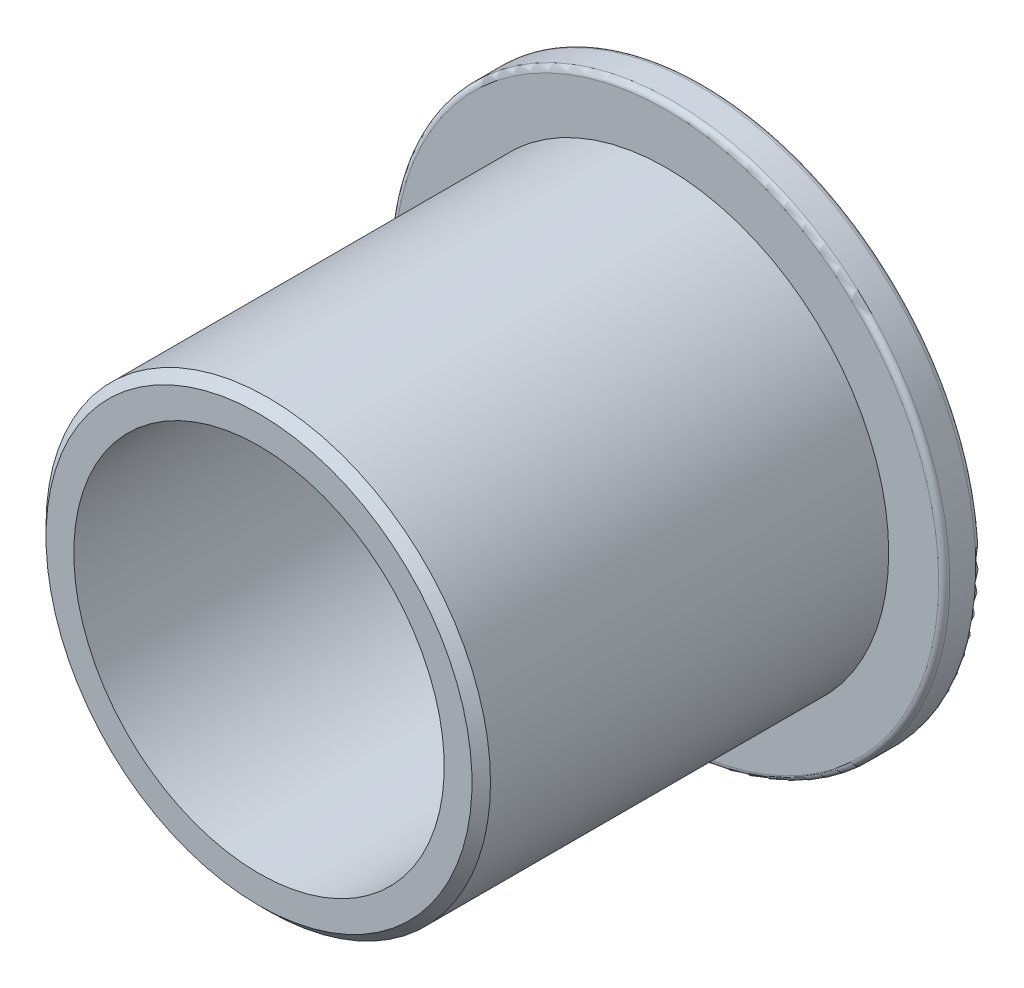
ISO-10303-21;
HEADER;
FILE_DESCRIPTION(('STEP AP214'),'2;1');
FILE_NAME('part.step','',(''),(''),'','','');
FILE_SCHEMA(('AUTOMOTIVE_DESIGN { 1 0 10303 214 1 1 1 1 }'));
ENDSEC;
DATA;
#1=APPLICATION_CONTEXT('core data for automotive mechanical design processes');
#2=APPLICATION_PROTOCOL_DEFINITION('international standard','automotive_design',2000,#1);
#3=PRODUCT_CONTEXT('',#1,'mechanical');
#4=PRODUCT('Part','Part','',(#3));
#5=PRODUCT_RELATED_PRODUCT_CATEGORY('part','',(#4));
#6=PRODUCT_DEFINITION_FORMATION('','',#4);
#7=PRODUCT_DEFINITION_CONTEXT('part definition',#1,'design');
#8=PRODUCT_DEFINITION('design','',#6,#7);
#9=PRODUCT_DEFINITION_SHAPE('','',#8);
#10=(LENGTH_UNIT() NAMED_UNIT(*) SI_UNIT(.MILLI.,.METRE.));
#11=(NAMED_UNIT(*) PLANE_ANGLE_UNIT() SI_UNIT($,.RADIAN.));
#12=(NAMED_UNIT(*) SI_UNIT($,.STERADIAN.) SOLID_ANGLE_UNIT());
#13=UNCERTAINTY_MEASURE_WITH_UNIT(LENGTH_MEASURE(1.E-05),#10,'distance_accuracy_value','');
#14=(GEOMETRIC_REPRESENTATION_CONTEXT(3) GLOBAL_UNCERTAINTY_ASSIGNED_CONTEXT((#13)) GLOBAL_UNIT_ASSIGNED_CONTEXT((#10,
#11,#12)) REPRESENTATION_CONTEXT('',''));
#15=CARTESIAN_POINT('',(0.,0.,0.));
#16=DIRECTION('',(0.,0.,1.));
#17=DIRECTION('',(1.,0.,0.));
#18=AXIS2_PLACEMENT_3D('',#15,#16,#17);
#19=CARTESIAN_POINT('',(0.,9.525,9.52500000000001));
#20=DIRECTION('',(0.,0.,-1.));
#21=DIRECTION('',(0.,1.,0.));
#22=AXIS2_PLACEMENT_3D('',#19,#20,#21);
#23=PLANE('',#22);
#24=CARTESIAN_POINT('',(0.,0.,9.525));
#25=DIRECTION('',(0.,0.,-1.));
#26=DIRECTION('',(0.,1.,0.));
#27=AXIS2_PLACEMENT_3D('',#24,#25,#26);
#28=CIRCLE('',#27,9.128125);
#29=CARTESIAN_POINT('',(0.,9.128125,9.52500000000001));
#30=VERTEX_POINT('',#29);
#31=EDGE_CURVE('E81',#30,#30,#28,.F.);
#32=ORIENTED_EDGE('',*,*,#31,.T.);
#33=EDGE_LOOP('',(#32));
#34=FACE_BOUND('',#33,.T.);
#35=CARTESIAN_POINT('',(0.,0.,9.525));
#36=DIRECTION('',(0.,0.,1.));
#37=DIRECTION('',(0.,-1.,0.));
#38=AXIS2_PLACEMENT_3D('',#35,#36,#37);
#39=CIRCLE('',#38,7.9375);
#40=CARTESIAN_POINT('',(0.,-7.9375,9.525));
#41=VERTEX_POINT('',#40);
#42=EDGE_CURVE('E85',#41,#41,#39,.T.);
#43=ORIENTED_EDGE('',*,*,#42,.F.);
#44=EDGE_LOOP('',(#43));
#45=FACE_BOUND('',#44,.T.);
#46=ADVANCED_FACE('F45',(#34,#45),#23,.F.);
#47=CARTESIAN_POINT('',(0.,0.,9.525));
#48=DIRECTION('',(0.,0.,1.));
#49=DIRECTION('',(0.,-1.,0.));
#50=AXIS2_PLACEMENT_3D('',#47,#48,#49);
#51=CYLINDRICAL_SURFACE('',#50,7.9375);
#52=CARTESIAN_POINT('',(0.,0.,-8.73125));
#53=DIRECTION('',(0.,0.,1.));
#54=DIRECTION('',(0.,-1.,0.));
#55=AXIS2_PLACEMENT_3D('',#52,#53,#54);
#56=CIRCLE('',#55,7.9375);
#57=CARTESIAN_POINT('',(0.,-7.93749999999999,-8.73125));
#58=VERTEX_POINT('',#57);
#59=EDGE_CURVE('E10',#58,#58,#56,.F.);
#60=ORIENTED_EDGE('',*,*,#59,.T.);
#61=EDGE_LOOP('',(#60));
#62=FACE_BOUND('',#61,.T.);
#63=ORIENTED_EDGE('',*,*,#42,.T.);
#64=EDGE_LOOP('',(#63));
#65=FACE_BOUND('',#64,.T.);
#66=ADVANCED_FACE('F113',(#62,#65),#51,.F.);
#67=CARTESIAN_POINT('',(0.,7.9375,-9.525));
#68=DIRECTION('',(0.,0.,1.));
#69=DIRECTION('',(0.,-1.,0.));
#70=AXIS2_PLACEMENT_3D('',#67,#68,#69);
#71=PLANE('',#70);
#72=CARTESIAN_POINT('',(0.,0.,-9.525));
#73=DIRECTION('',(0.,0.,1.));
#74=DIRECTION('',(0.,-1.,0.));
#75=AXIS2_PLACEMENT_3D('',#72,#73,#74);
#76=CIRCLE('',#75,8.73124999999999);
#77=CARTESIAN_POINT('',(0.,-8.73124999999999,-9.525));
#78=VERTEX_POINT('',#77);
#79=EDGE_CURVE('E53',#78,#78,#76,.T.);
#80=ORIENTED_EDGE('',*,*,#79,.T.);
#81=EDGE_LOOP('',(#80));
#82=FACE_BOUND('',#81,.T.);
#83=CARTESIAN_POINT('',(0.,0.,-9.525));
#84=DIRECTION('',(0.,0.,1.));
#85=DIRECTION('',(0.,-1.,0.));
#86=AXIS2_PLACEMENT_3D('',#83,#84,#85);
#87=CIRCLE('',#86,11.668125);
#88=CARTESIAN_POINT('',(0.,-11.668125,-9.525));
#89=VERTEX_POINT('',#88);
#90=EDGE_CURVE('E63',#89,#89,#87,.F.);
#91=ORIENTED_EDGE('',*,*,#90,.T.);
#92=EDGE_LOOP('',(#91));
#93=FACE_BOUND('',#92,.T.);
#94=ADVANCED_FACE('F109',(#82,#93),#71,.F.);
#95=CARTESIAN_POINT('',(0.,0.,9.525));
#96=DIRECTION('',(0.,0.,1.));
#97=DIRECTION('',(0.,-1.,0.));
#98=AXIS2_PLACEMENT_3D('',#95,#96,#97);
#99=CYLINDRICAL_SURFACE('',#98,11.90625);
#100=CARTESIAN_POINT('',(0.,0.,-9.28687499999999));
#101=DIRECTION('',(0.,0.,1.));
#102=DIRECTION('',(0.,-1.,0.));
#103=AXIS2_PLACEMENT_3D('',#100,#101,#102);
#104=CIRCLE('',#103,11.90625);
#105=CARTESIAN_POINT('',(0.,-11.90625,-9.286875));
#106=VERTEX_POINT('',#105);
#107=EDGE_CURVE('E69',#106,#106,#104,.T.);
#108=ORIENTED_EDGE('',*,*,#107,.T.);
#109=EDGE_LOOP('',(#108));
#110=FACE_BOUND('',#109,.T.);
#111=CARTESIAN_POINT('',(0.,0.,-8.17562499999999));
#112=DIRECTION('',(0.,0.,-1.));
#113=DIRECTION('',(0.,1.,0.));
#114=AXIS2_PLACEMENT_3D('',#111,#112,#113);
#115=CIRCLE('',#114,11.90625);
#116=CARTESIAN_POINT('',(0.,11.90625,-8.17562499999999));
#117=VERTEX_POINT('',#116);
#118=EDGE_CURVE('E73',#117,#117,#115,.T.);
#119=ORIENTED_EDGE('',*,*,#118,.T.);
#120=EDGE_LOOP('',(#119));
#121=FACE_BOUND('',#120,.T.);
#122=ADVANCED_FACE('F98',(#110,#121),#99,.T.);
#123=CARTESIAN_POINT('',(0.,11.90625,-7.93749999999999));
#124=DIRECTION('',(0.,0.,-1.));
#125=DIRECTION('',(0.,1.,0.));
#126=AXIS2_PLACEMENT_3D('',#123,#124,#125);
#127=PLANE('',#126);
#128=CARTESIAN_POINT('',(0.,0.,-7.93749999999999));
#129=DIRECTION('',(0.,0.,-1.));
#130=DIRECTION('',(0.,1.,0.));
#131=AXIS2_PLACEMENT_3D('',#128,#129,#130);
#132=CIRCLE('',#131,11.668125);
#133=CARTESIAN_POINT('',(0.,11.668125,-7.93749999999999));
#134=VERTEX_POINT('',#133);
#135=EDGE_CURVE('E58',#134,#134,#132,.F.);
#136=ORIENTED_EDGE('',*,*,#135,.T.);
#137=EDGE_LOOP('',(#136));
#138=FACE_BOUND('',#137,.T.);
#139=CARTESIAN_POINT('',(0.,0.,-7.93749999999999));
#140=DIRECTION('',(0.,0.,1.));
#141=DIRECTION('',(0.,-1.,0.));
#142=AXIS2_PLACEMENT_3D('',#139,#140,#141);
#143=CIRCLE('',#142,9.525);
#144=CARTESIAN_POINT('',(0.,-9.525,-7.9375));
#145=VERTEX_POINT('',#144);
#146=EDGE_CURVE('E89',#145,#145,#143,.T.);
#147=ORIENTED_EDGE('',*,*,#146,.F.);
#148=EDGE_LOOP('',(#147));
#149=FACE_BOUND('',#148,.T.);
#150=ADVANCED_FACE('F96',(#138,#149),#127,.F.);
#151=CARTESIAN_POINT('',(0.,0.,9.525));
#152=DIRECTION('',(0.,0.,1.));
#153=DIRECTION('',(0.,-1.,0.));
#154=AXIS2_PLACEMENT_3D('',#151,#152,#153);
#155=CYLINDRICAL_SURFACE('',#154,9.525);
#156=CARTESIAN_POINT('',(0.,0.,9.12812500000001));
#157=DIRECTION('',(0.,0.,-1.));
#158=DIRECTION('',(0.,1.,0.));
#159=AXIS2_PLACEMENT_3D('',#156,#157,#158);
#160=CIRCLE('',#159,9.525);
#161=CARTESIAN_POINT('',(0.,9.525,9.12812500000001));
#162=VERTEX_POINT('',#161);
#163=EDGE_CURVE('E77',#162,#162,#160,.T.);
#164=ORIENTED_EDGE('',*,*,#163,.T.);
#165=EDGE_LOOP('',(#164));
#166=FACE_BOUND('',#165,.T.);
#167=ORIENTED_EDGE('',*,*,#146,.T.);
#168=EDGE_LOOP('',(#167));
#169=FACE_BOUND('',#168,.T.);
#170=ADVANCED_FACE('F94',(#166,#169),#155,.T.);
#171=CARTESIAN_POINT('',(0.,0.,9.525));
#172=DIRECTION('',(0.,0.,-1.));
#173=DIRECTION('',(0.,1.,0.));
#174=AXIS2_PLACEMENT_3D('',#171,#172,#173);
#175=CONICAL_SURFACE('',#174,9.128125,0.785398163397446);
#176=ORIENTED_EDGE('',*,*,#163,.F.);
#177=EDGE_LOOP('',(#176));
#178=FACE_BOUND('',#177,.T.);
#179=ORIENTED_EDGE('',*,*,#31,.F.);
#180=EDGE_LOOP('',(#179));
#181=FACE_BOUND('',#180,.T.);
#182=ADVANCED_FACE('F106',(#178,#181),#175,.T.);
#183=CARTESIAN_POINT('',(0.,0.,-9.28687499999999));
#184=DIRECTION('',(0.,0.,1.));
#185=DIRECTION('',(0.,-1.,0.));
#186=AXIS2_PLACEMENT_3D('',#183,#184,#185);
#187=TOROIDAL_SURFACE('',#186,11.668125,0.238125);
#188=ORIENTED_EDGE('',*,*,#90,.F.);
#189=EDGE_LOOP('',(#188));
#190=FACE_BOUND('',#189,.T.);
#191=ORIENTED_EDGE('',*,*,#107,.F.);
#192=EDGE_LOOP('',(#191));
#193=FACE_BOUND('',#192,.T.);
#194=ADVANCED_FACE('F125',(#190,#193),#187,.T.);
#195=CARTESIAN_POINT('',(0.,0.,-8.175625));
#196=DIRECTION('',(0.,0.,-1.));
#197=DIRECTION('',(0.,1.,0.));
#198=AXIS2_PLACEMENT_3D('',#195,#196,#197);
#199=TOROIDAL_SURFACE('',#198,11.668125,0.238125);
#200=ORIENTED_EDGE('',*,*,#118,.F.);
#201=EDGE_LOOP('',(#200));
#202=FACE_BOUND('',#201,.T.);
#203=ORIENTED_EDGE('',*,*,#135,.F.);
#204=EDGE_LOOP('',(#203));
#205=FACE_BOUND('',#204,.T.);
#206=ADVANCED_FACE('F127',(#202,#205),#199,.T.);
#207=CARTESIAN_POINT('',(0.,0.,-9.525));
#208=DIRECTION('',(0.,0.,-1.));
#209=DIRECTION('',(0.,1.,0.));
#210=AXIS2_PLACEMENT_3D('',#207,#208,#209);
#211=CONICAL_SURFACE('',#210,8.73124999999999,0.785398163397447);
#212=ORIENTED_EDGE('',*,*,#59,.F.);
#213=EDGE_LOOP('',(#212));
#214=FACE_BOUND('',#213,.T.);
#215=ORIENTED_EDGE('',*,*,#79,.F.);
#216=EDGE_LOOP('',(#215));
#217=FACE_BOUND('',#216,.T.);
#218=ADVANCED_FACE('F47',(#214,#217),#211,.F.);
#219=CLOSED_SHELL('',(#46,#66,#94,#122,#150,#170,#182,#194,#206,#218));
#220=MANIFOLD_SOLID_BREP('B2',#219);
#221=ADVANCED_BREP_SHAPE_REPRESENTATION('',(#18,#220),#14);
#222=SHAPE_DEFINITION_REPRESENTATION(#9,#221);
ENDSEC;
END-ISO-10303-21;
